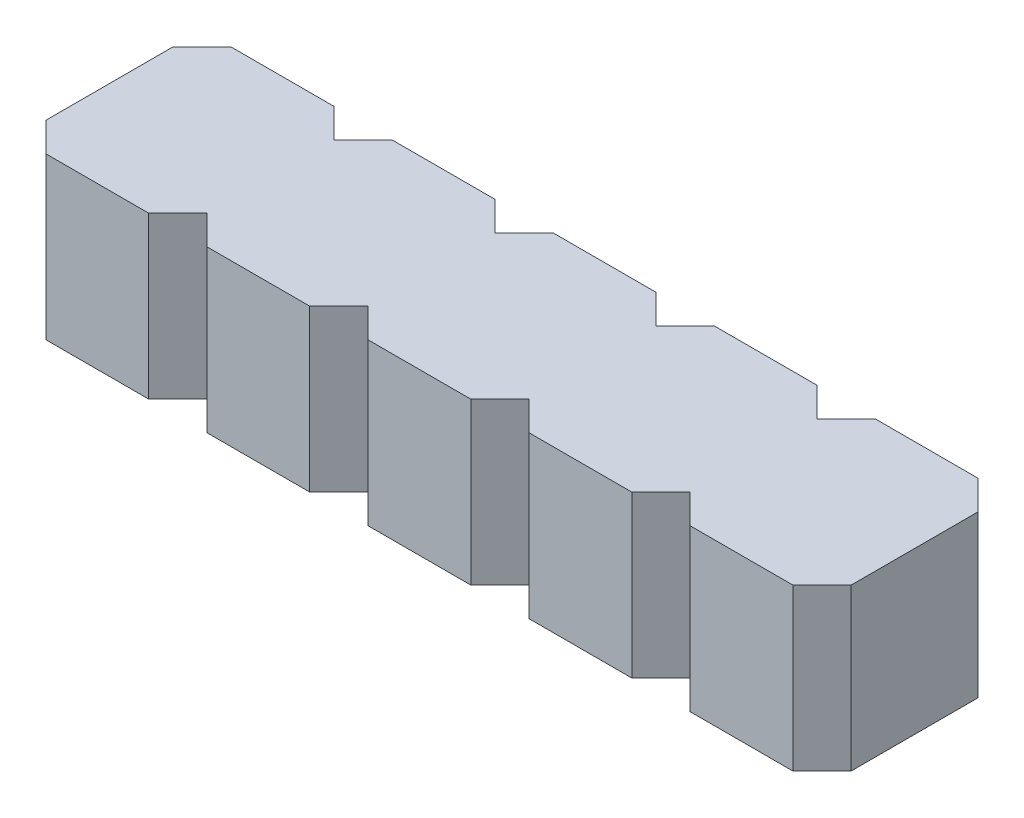
ISO-10303-21;
HEADER;
FILE_DESCRIPTION(('STEP AP214'),'2;1');
FILE_NAME('part.step','',(''),(''),'','','');
FILE_SCHEMA(('AUTOMOTIVE_DESIGN { 1 0 10303 214 1 1 1 1 }'));
ENDSEC;
DATA;
#1=APPLICATION_CONTEXT('core data for automotive mechanical design processes');
#2=APPLICATION_PROTOCOL_DEFINITION('international standard','automotive_design',2000,#1);
#3=PRODUCT_CONTEXT('',#1,'mechanical');
#4=PRODUCT('Part','Part','',(#3));
#5=PRODUCT_RELATED_PRODUCT_CATEGORY('part','',(#4));
#6=PRODUCT_DEFINITION_FORMATION('','',#4);
#7=PRODUCT_DEFINITION_CONTEXT('part definition',#1,'design');
#8=PRODUCT_DEFINITION('design','',#6,#7);
#9=PRODUCT_DEFINITION_SHAPE('','',#8);
#10=(LENGTH_UNIT() NAMED_UNIT(*) SI_UNIT(.MILLI.,.METRE.));
#11=(NAMED_UNIT(*) PLANE_ANGLE_UNIT() SI_UNIT($,.RADIAN.));
#12=(NAMED_UNIT(*) SI_UNIT($,.STERADIAN.) SOLID_ANGLE_UNIT());
#13=UNCERTAINTY_MEASURE_WITH_UNIT(LENGTH_MEASURE(1.E-05),#10,'distance_accuracy_value','');
#14=(GEOMETRIC_REPRESENTATION_CONTEXT(3) GLOBAL_UNCERTAINTY_ASSIGNED_CONTEXT((#13)) GLOBAL_UNIT_ASSIGNED_CONTEXT((#10,
#11,#12)) REPRESENTATION_CONTEXT('',''));
#15=CARTESIAN_POINT('',(0.,0.,0.));
#16=DIRECTION('',(0.,0.,1.));
#17=DIRECTION('',(1.,0.,0.));
#18=AXIS2_PLACEMENT_3D('',#15,#16,#17);
#19=CARTESIAN_POINT('',(5.08,0.,-1.46));
#20=DIRECTION('',(0.,0.,-1.));
#21=DIRECTION('',(-1.,0.,0.));
#22=AXIS2_PLACEMENT_3D('',#19,#20,#21);
#23=PLANE('',#22);
#24=DIRECTION('',(-1.,0.,0.));
#25=VECTOR('',#24,1.);
#26=CARTESIAN_POINT('',(5.08,2.54,-1.46));
#27=LINE('',#26,#25);
#28=CARTESIAN_POINT('',(4.27,2.54,-1.46));
#29=VERTEX_POINT('',#28);
#30=CARTESIAN_POINT('',(5.89,2.54,-1.46));
#31=VERTEX_POINT('',#30);
#32=EDGE_CURVE('E246',#29,#31,#27,.F.);
#33=ORIENTED_EDGE('',*,*,#32,.T.);
#34=DIRECTION('',(0.,1.,0.));
#35=VECTOR('',#34,1.);
#36=CARTESIAN_POINT('',(5.89,0.,-1.46));
#37=LINE('',#36,#35);
#38=CARTESIAN_POINT('',(5.89,0.,-1.46));
#39=VERTEX_POINT('',#38);
#40=EDGE_CURVE('E263',#39,#31,#37,.T.);
#41=ORIENTED_EDGE('',*,*,#40,.F.);
#42=DIRECTION('',(-1.,0.,0.));
#43=VECTOR('',#42,1.);
#44=CARTESIAN_POINT('',(5.08,0.,-1.46));
#45=LINE('',#44,#43);
#46=CARTESIAN_POINT('',(4.27,0.,-1.46));
#47=VERTEX_POINT('',#46);
#48=EDGE_CURVE('E20',#39,#47,#45,.T.);
#49=ORIENTED_EDGE('',*,*,#48,.T.);
#50=DIRECTION('',(0.,1.,0.));
#51=VECTOR('',#50,1.);
#52=CARTESIAN_POINT('',(4.27,0.,-1.46));
#53=LINE('',#52,#51);
#54=EDGE_CURVE('E262',#29,#47,#53,.F.);
#55=ORIENTED_EDGE('',*,*,#54,.F.);
#56=EDGE_LOOP('',(#33,#41,#49,#55));
#57=FACE_BOUND('',#56,.T.);
#58=ADVANCED_FACE('F17',(#57),#23,.T.);
#59=CARTESIAN_POINT('',(5.08,0.,1.46));
#60=DIRECTION('',(0.,0.,1.));
#61=DIRECTION('',(1.,0.,0.));
#62=AXIS2_PLACEMENT_3D('',#59,#60,#61);
#63=PLANE('',#62);
#64=DIRECTION('',(1.,0.,0.));
#65=VECTOR('',#64,1.);
#66=CARTESIAN_POINT('',(5.08,2.54,1.46));
#67=LINE('',#66,#65);
#68=CARTESIAN_POINT('',(5.89,2.54,1.46));
#69=VERTEX_POINT('',#68);
#70=CARTESIAN_POINT('',(4.27,2.54,1.46));
#71=VERTEX_POINT('',#70);
#72=EDGE_CURVE('E224',#69,#71,#67,.F.);
#73=ORIENTED_EDGE('',*,*,#72,.T.);
#74=DIRECTION('',(0.,1.,0.));
#75=VECTOR('',#74,1.);
#76=CARTESIAN_POINT('',(4.27,0.,1.46));
#77=LINE('',#76,#75);
#78=CARTESIAN_POINT('',(4.27,0.,1.46));
#79=VERTEX_POINT('',#78);
#80=EDGE_CURVE('E233',#79,#71,#77,.T.);
#81=ORIENTED_EDGE('',*,*,#80,.F.);
#82=DIRECTION('',(1.,0.,0.));
#83=VECTOR('',#82,1.);
#84=CARTESIAN_POINT('',(5.08,0.,1.46));
#85=LINE('',#84,#83);
#86=CARTESIAN_POINT('',(5.89,0.,1.46));
#87=VERTEX_POINT('',#86);
#88=EDGE_CURVE('E240',#79,#87,#85,.T.);
#89=ORIENTED_EDGE('',*,*,#88,.T.);
#90=DIRECTION('',(0.,1.,0.));
#91=VECTOR('',#90,1.);
#92=CARTESIAN_POINT('',(5.89,0.,1.46));
#93=LINE('',#92,#91);
#94=EDGE_CURVE('E285',#69,#87,#93,.F.);
#95=ORIENTED_EDGE('',*,*,#94,.F.);
#96=EDGE_LOOP('',(#73,#81,#89,#95));
#97=FACE_BOUND('',#96,.T.);
#98=ADVANCED_FACE('F248',(#97),#63,.T.);
#99=CARTESIAN_POINT('',(4.04,0.,1.23));
#100=DIRECTION('',(-0.707106781186548,0.,0.707106781186548));
#101=DIRECTION('',(0.707106781186548,0.,0.707106781186548));
#102=AXIS2_PLACEMENT_3D('',#99,#100,#101);
#103=PLANE('',#102);
#104=DIRECTION('',(0.707106781186548,0.,0.707106781186548));
#105=VECTOR('',#104,1.);
#106=CARTESIAN_POINT('',(4.04,2.54,1.23));
#107=LINE('',#106,#105);
#108=CARTESIAN_POINT('',(3.81,2.54,1.));
#109=VERTEX_POINT('',#108);
#110=EDGE_CURVE('E249',#71,#109,#107,.F.);
#111=ORIENTED_EDGE('',*,*,#110,.T.);
#112=DIRECTION('',(0.,1.,0.));
#113=VECTOR('',#112,1.);
#114=CARTESIAN_POINT('',(3.81,0.,1.));
#115=LINE('',#114,#113);
#116=CARTESIAN_POINT('',(3.81,0.,1.));
#117=VERTEX_POINT('',#116);
#118=EDGE_CURVE('E236',#117,#109,#115,.T.);
#119=ORIENTED_EDGE('',*,*,#118,.F.);
#120=DIRECTION('',(0.707106781186548,0.,0.707106781186548));
#121=VECTOR('',#120,1.);
#122=CARTESIAN_POINT('',(4.04,0.,1.23));
#123=LINE('',#122,#121);
#124=EDGE_CURVE('E230',#117,#79,#123,.T.);
#125=ORIENTED_EDGE('',*,*,#124,.T.);
#126=ORIENTED_EDGE('',*,*,#80,.T.);
#127=EDGE_LOOP('',(#111,#119,#125,#126));
#128=FACE_BOUND('',#127,.T.);
#129=ADVANCED_FACE('F232',(#128),#103,.T.);
#130=CARTESIAN_POINT('',(4.04,0.,-1.23));
#131=DIRECTION('',(-0.707106781186548,0.,-0.707106781186548));
#132=DIRECTION('',(-0.707106781186548,0.,0.707106781186548));
#133=AXIS2_PLACEMENT_3D('',#130,#131,#132);
#134=PLANE('',#133);
#135=DIRECTION('',(-0.707106781186548,0.,0.707106781186548));
#136=VECTOR('',#135,1.);
#137=CARTESIAN_POINT('',(4.04,2.54,-1.23));
#138=LINE('',#137,#136);
#139=CARTESIAN_POINT('',(3.81,2.54,-1.));
#140=VERTEX_POINT('',#139);
#141=EDGE_CURVE('E271',#140,#29,#138,.F.);
#142=ORIENTED_EDGE('',*,*,#141,.T.);
#143=ORIENTED_EDGE('',*,*,#54,.T.);
#144=DIRECTION('',(-0.707106781186548,0.,0.707106781186548));
#145=VECTOR('',#144,1.);
#146=CARTESIAN_POINT('',(4.04,0.,-1.23));
#147=LINE('',#146,#145);
#148=CARTESIAN_POINT('',(3.81,0.,-1.));
#149=VERTEX_POINT('',#148);
#150=EDGE_CURVE('E251',#47,#149,#147,.T.);
#151=ORIENTED_EDGE('',*,*,#150,.T.);
#152=DIRECTION('',(0.,1.,0.));
#153=VECTOR('',#152,1.);
#154=CARTESIAN_POINT('',(3.81,0.,-1.));
#155=LINE('',#154,#153);
#156=EDGE_CURVE('E295',#140,#149,#155,.F.);
#157=ORIENTED_EDGE('',*,*,#156,.F.);
#158=EDGE_LOOP('',(#142,#143,#151,#157));
#159=FACE_BOUND('',#158,.T.);
#160=ADVANCED_FACE('F267',(#159),#134,.T.);
#161=CARTESIAN_POINT('',(6.12,0.,-1.23));
#162=DIRECTION('',(0.707106781186548,0.,-0.707106781186548));
#163=DIRECTION('',(-0.707106781186548,0.,-0.707106781186548));
#164=AXIS2_PLACEMENT_3D('',#161,#162,#163);
#165=PLANE('',#164);
#166=DIRECTION('',(-0.707106781186548,0.,-0.707106781186548));
#167=VECTOR('',#166,1.);
#168=CARTESIAN_POINT('',(6.12,2.54,-1.23));
#169=LINE('',#168,#167);
#170=CARTESIAN_POINT('',(6.35,2.54,-1.));
#171=VERTEX_POINT('',#170);
#172=EDGE_CURVE('E280',#31,#171,#169,.F.);
#173=ORIENTED_EDGE('',*,*,#172,.T.);
#174=DIRECTION('',(0.,1.,0.));
#175=VECTOR('',#174,1.);
#176=CARTESIAN_POINT('',(6.35,0.,-1.));
#177=LINE('',#176,#175);
#178=CARTESIAN_POINT('',(6.35,0.,-1.));
#179=VERTEX_POINT('',#178);
#180=EDGE_CURVE('E299',#179,#171,#177,.T.);
#181=ORIENTED_EDGE('',*,*,#180,.F.);
#182=DIRECTION('',(-0.707106781186548,0.,-0.707106781186548));
#183=VECTOR('',#182,1.);
#184=CARTESIAN_POINT('',(6.12,0.,-1.23));
#185=LINE('',#184,#183);
#186=EDGE_CURVE('E272',#179,#39,#185,.T.);
#187=ORIENTED_EDGE('',*,*,#186,.T.);
#188=ORIENTED_EDGE('',*,*,#40,.T.);
#189=EDGE_LOOP('',(#173,#181,#187,#188));
#190=FACE_BOUND('',#189,.T.);
#191=ADVANCED_FACE('F515',(#190),#165,.T.);
#192=CARTESIAN_POINT('',(6.12,0.,1.23));
#193=DIRECTION('',(0.707106781186548,0.,0.707106781186548));
#194=DIRECTION('',(0.707106781186548,0.,-0.707106781186548));
#195=AXIS2_PLACEMENT_3D('',#192,#193,#194);
#196=PLANE('',#195);
#197=DIRECTION('',(0.707106781186548,0.,-0.707106781186548));
#198=VECTOR('',#197,1.);
#199=CARTESIAN_POINT('',(6.12,2.54,1.23));
#200=LINE('',#199,#198);
#201=CARTESIAN_POINT('',(6.35,2.54,1.));
#202=VERTEX_POINT('',#201);
#203=EDGE_CURVE('E283',#202,#69,#200,.F.);
#204=ORIENTED_EDGE('',*,*,#203,.T.);
#205=ORIENTED_EDGE('',*,*,#94,.T.);
#206=DIRECTION('',(0.707106781186548,0.,-0.707106781186548));
#207=VECTOR('',#206,1.);
#208=CARTESIAN_POINT('',(6.12,0.,1.23));
#209=LINE('',#208,#207);
#210=CARTESIAN_POINT('',(6.35,0.,1.));
#211=VERTEX_POINT('',#210);
#212=EDGE_CURVE('E244',#87,#211,#209,.T.);
#213=ORIENTED_EDGE('',*,*,#212,.T.);
#214=DIRECTION('',(0.,1.,0.));
#215=VECTOR('',#214,1.);
#216=CARTESIAN_POINT('',(6.35,0.,1.));
#217=LINE('',#216,#215);
#218=EDGE_CURVE('E308',#202,#211,#217,.F.);
#219=ORIENTED_EDGE('',*,*,#218,.F.);
#220=EDGE_LOOP('',(#204,#205,#213,#219));
#221=FACE_BOUND('',#220,.T.);
#222=ADVANCED_FACE('F575',(#221),#196,.T.);
#223=CARTESIAN_POINT('',(3.58,0.,1.23));
#224=DIRECTION('',(0.707106781186548,0.,0.707106781186548));
#225=DIRECTION('',(0.707106781186548,0.,-0.707106781186548));
#226=AXIS2_PLACEMENT_3D('',#223,#224,#225);
#227=PLANE('',#226);
#228=DIRECTION('',(0.707106781186548,0.,-0.707106781186548));
#229=VECTOR('',#228,1.);
#230=CARTESIAN_POINT('',(3.58,2.54,1.23));
#231=LINE('',#230,#229);
#232=CARTESIAN_POINT('',(3.35,2.54,1.46));
#233=VERTEX_POINT('',#232);
#234=EDGE_CURVE('E290',#109,#233,#231,.F.);
#235=ORIENTED_EDGE('',*,*,#234,.T.);
#236=DIRECTION('',(0.,1.,0.));
#237=VECTOR('',#236,1.);
#238=CARTESIAN_POINT('',(3.35,0.,1.46));
#239=LINE('',#238,#237);
#240=CARTESIAN_POINT('',(3.35,0.,1.46));
#241=VERTEX_POINT('',#240);
#242=EDGE_CURVE('E313',#241,#233,#239,.T.);
#243=ORIENTED_EDGE('',*,*,#242,.F.);
#244=DIRECTION('',(0.707106781186548,0.,-0.707106781186548));
#245=VECTOR('',#244,1.);
#246=CARTESIAN_POINT('',(3.58,0.,1.23));
#247=LINE('',#246,#245);
#248=EDGE_CURVE('E287',#241,#117,#247,.T.);
#249=ORIENTED_EDGE('',*,*,#248,.T.);
#250=ORIENTED_EDGE('',*,*,#118,.T.);
#251=EDGE_LOOP('',(#235,#243,#249,#250));
#252=FACE_BOUND('',#251,.T.);
#253=ADVANCED_FACE('F579',(#252),#227,.T.);
#254=CARTESIAN_POINT('',(3.58,0.,-1.23));
#255=DIRECTION('',(0.707106781186548,0.,-0.707106781186548));
#256=DIRECTION('',(-0.707106781186548,0.,-0.707106781186548));
#257=AXIS2_PLACEMENT_3D('',#254,#255,#256);
#258=PLANE('',#257);
#259=DIRECTION('',(-0.707106781186548,0.,-0.707106781186548));
#260=VECTOR('',#259,1.);
#261=CARTESIAN_POINT('',(3.58,2.54,-1.23));
#262=LINE('',#261,#260);
#263=CARTESIAN_POINT('',(3.35,2.54,-1.46));
#264=VERTEX_POINT('',#263);
#265=EDGE_CURVE('E293',#264,#140,#262,.F.);
#266=ORIENTED_EDGE('',*,*,#265,.T.);
#267=ORIENTED_EDGE('',*,*,#156,.T.);
#268=DIRECTION('',(-0.707106781186548,0.,-0.707106781186548));
#269=VECTOR('',#268,1.);
#270=CARTESIAN_POINT('',(3.58,0.,-1.23));
#271=LINE('',#270,#269);
#272=CARTESIAN_POINT('',(3.35,0.,-1.46));
#273=VERTEX_POINT('',#272);
#274=EDGE_CURVE('E275',#149,#273,#271,.T.);
#275=ORIENTED_EDGE('',*,*,#274,.T.);
#276=DIRECTION('',(0.,1.,0.));
#277=VECTOR('',#276,1.);
#278=CARTESIAN_POINT('',(3.35,0.,-1.46));
#279=LINE('',#278,#277);
#280=EDGE_CURVE('E322',#264,#273,#279,.F.);
#281=ORIENTED_EDGE('',*,*,#280,.F.);
#282=EDGE_LOOP('',(#266,#267,#275,#281));
#283=FACE_BOUND('',#282,.T.);
#284=ADVANCED_FACE('F509',(#283),#258,.T.);
#285=CARTESIAN_POINT('',(6.58,0.,-1.23));
#286=DIRECTION('',(-0.707106781186548,0.,-0.707106781186548));
#287=DIRECTION('',(-0.707106781186548,0.,0.707106781186548));
#288=AXIS2_PLACEMENT_3D('',#285,#286,#287);
#289=PLANE('',#288);
#290=DIRECTION('',(-0.707106781186548,0.,0.707106781186548));
#291=VECTOR('',#290,1.);
#292=CARTESIAN_POINT('',(6.58,2.54,-1.23));
#293=LINE('',#292,#291);
#294=CARTESIAN_POINT('',(6.81,2.54,-1.46));
#295=VERTEX_POINT('',#294);
#296=EDGE_CURVE('E302',#171,#295,#293,.F.);
#297=ORIENTED_EDGE('',*,*,#296,.T.);
#298=DIRECTION('',(0.,1.,0.));
#299=VECTOR('',#298,1.);
#300=CARTESIAN_POINT('',(6.81,0.,-1.46));
#301=LINE('',#300,#299);
#302=CARTESIAN_POINT('',(6.81,0.,-1.46));
#303=VERTEX_POINT('',#302);
#304=EDGE_CURVE('E327',#303,#295,#301,.T.);
#305=ORIENTED_EDGE('',*,*,#304,.F.);
#306=DIRECTION('',(-0.707106781186548,0.,0.707106781186548));
#307=VECTOR('',#306,1.);
#308=CARTESIAN_POINT('',(6.58,0.,-1.23));
#309=LINE('',#308,#307);
#310=EDGE_CURVE('E297',#303,#179,#309,.T.);
#311=ORIENTED_EDGE('',*,*,#310,.T.);
#312=ORIENTED_EDGE('',*,*,#180,.T.);
#313=EDGE_LOOP('',(#297,#305,#311,#312));
#314=FACE_BOUND('',#313,.T.);
#315=ADVANCED_FACE('F517',(#314),#289,.T.);
#316=CARTESIAN_POINT('',(6.58,0.,1.23));
#317=DIRECTION('',(-0.707106781186548,0.,0.707106781186548));
#318=DIRECTION('',(0.707106781186548,0.,0.707106781186548));
#319=AXIS2_PLACEMENT_3D('',#316,#317,#318);
#320=PLANE('',#319);
#321=DIRECTION('',(0.707106781186548,0.,0.707106781186548));
#322=VECTOR('',#321,1.);
#323=CARTESIAN_POINT('',(6.58,2.54,1.23));
#324=LINE('',#323,#322);
#325=CARTESIAN_POINT('',(6.81,2.54,1.46));
#326=VERTEX_POINT('',#325);
#327=EDGE_CURVE('E306',#326,#202,#324,.F.);
#328=ORIENTED_EDGE('',*,*,#327,.T.);
#329=ORIENTED_EDGE('',*,*,#218,.T.);
#330=DIRECTION('',(0.707106781186548,0.,0.707106781186548));
#331=VECTOR('',#330,1.);
#332=CARTESIAN_POINT('',(6.58,0.,1.23));
#333=LINE('',#332,#331);
#334=CARTESIAN_POINT('',(6.81,0.,1.46));
#335=VERTEX_POINT('',#334);
#336=EDGE_CURVE('E304',#211,#335,#333,.T.);
#337=ORIENTED_EDGE('',*,*,#336,.T.);
#338=DIRECTION('',(0.,1.,0.));
#339=VECTOR('',#338,1.);
#340=CARTESIAN_POINT('',(6.81,0.,1.46));
#341=LINE('',#340,#339);
#342=EDGE_CURVE('E336',#326,#335,#341,.F.);
#343=ORIENTED_EDGE('',*,*,#342,.F.);
#344=EDGE_LOOP('',(#328,#329,#337,#343));
#345=FACE_BOUND('',#344,.T.);
#346=ADVANCED_FACE('F571',(#345),#320,.T.);
#347=CARTESIAN_POINT('',(2.54,0.,1.46));
#348=DIRECTION('',(0.,0.,1.));
#349=DIRECTION('',(1.,0.,0.));
#350=AXIS2_PLACEMENT_3D('',#347,#348,#349);
#351=PLANE('',#350);
#352=DIRECTION('',(1.,0.,0.));
#353=VECTOR('',#352,1.);
#354=CARTESIAN_POINT('',(2.54,2.54,1.46));
#355=LINE('',#354,#353);
#356=CARTESIAN_POINT('',(1.73,2.54,1.46));
#357=VERTEX_POINT('',#356);
#358=EDGE_CURVE('E316',#233,#357,#355,.F.);
#359=ORIENTED_EDGE('',*,*,#358,.T.);
#360=DIRECTION('',(0.,1.,0.));
#361=VECTOR('',#360,1.);
#362=CARTESIAN_POINT('',(1.73,0.,1.46));
#363=LINE('',#362,#361);
#364=CARTESIAN_POINT('',(1.73,0.,1.46));
#365=VERTEX_POINT('',#364);
#366=EDGE_CURVE('E341',#365,#357,#363,.T.);
#367=ORIENTED_EDGE('',*,*,#366,.F.);
#368=DIRECTION('',(1.,0.,0.));
#369=VECTOR('',#368,1.);
#370=CARTESIAN_POINT('',(2.54,0.,1.46));
#371=LINE('',#370,#369);
#372=EDGE_CURVE('E311',#365,#241,#371,.T.);
#373=ORIENTED_EDGE('',*,*,#372,.T.);
#374=ORIENTED_EDGE('',*,*,#242,.T.);
#375=EDGE_LOOP('',(#359,#367,#373,#374));
#376=FACE_BOUND('',#375,.T.);
#377=ADVANCED_FACE('F586',(#376),#351,.T.);
#378=CARTESIAN_POINT('',(2.54,0.,-1.46));
#379=DIRECTION('',(0.,0.,-1.));
#380=DIRECTION('',(-1.,0.,0.));
#381=AXIS2_PLACEMENT_3D('',#378,#379,#380);
#382=PLANE('',#381);
#383=DIRECTION('',(-1.,0.,0.));
#384=VECTOR('',#383,1.);
#385=CARTESIAN_POINT('',(2.54,2.54,-1.46));
#386=LINE('',#385,#384);
#387=CARTESIAN_POINT('',(1.73,2.54,-1.46));
#388=VERTEX_POINT('',#387);
#389=EDGE_CURVE('E320',#388,#264,#386,.F.);
#390=ORIENTED_EDGE('',*,*,#389,.T.);
#391=ORIENTED_EDGE('',*,*,#280,.T.);
#392=DIRECTION('',(-1.,0.,0.));
#393=VECTOR('',#392,1.);
#394=CARTESIAN_POINT('',(2.54,0.,-1.46));
#395=LINE('',#394,#393);
#396=CARTESIAN_POINT('',(1.73,0.,-1.46));
#397=VERTEX_POINT('',#396);
#398=EDGE_CURVE('E318',#273,#397,#395,.T.);
#399=ORIENTED_EDGE('',*,*,#398,.T.);
#400=DIRECTION('',(0.,1.,0.));
#401=VECTOR('',#400,1.);
#402=CARTESIAN_POINT('',(1.73,0.,-1.46));
#403=LINE('',#402,#401);
#404=EDGE_CURVE('E350',#388,#397,#403,.F.);
#405=ORIENTED_EDGE('',*,*,#404,.F.);
#406=EDGE_LOOP('',(#390,#391,#399,#405));
#407=FACE_BOUND('',#406,.T.);
#408=ADVANCED_FACE('F505',(#407),#382,.T.);
#409=CARTESIAN_POINT('',(7.62,0.,-1.46));
#410=DIRECTION('',(0.,0.,-1.));
#411=DIRECTION('',(-1.,0.,0.));
#412=AXIS2_PLACEMENT_3D('',#409,#410,#411);
#413=PLANE('',#412);
#414=DIRECTION('',(-1.,0.,0.));
#415=VECTOR('',#414,1.);
#416=CARTESIAN_POINT('',(7.62,2.54,-1.46));
#417=LINE('',#416,#415);
#418=CARTESIAN_POINT('',(8.43,2.54,-1.46));
#419=VERTEX_POINT('',#418);
#420=EDGE_CURVE('E330',#295,#419,#417,.F.);
#421=ORIENTED_EDGE('',*,*,#420,.T.);
#422=DIRECTION('',(0.,1.,0.));
#423=VECTOR('',#422,1.);
#424=CARTESIAN_POINT('',(8.43,0.,-1.46));
#425=LINE('',#424,#423);
#426=CARTESIAN_POINT('',(8.43,0.,-1.46));
#427=VERTEX_POINT('',#426);
#428=EDGE_CURVE('E355',#427,#419,#425,.T.);
#429=ORIENTED_EDGE('',*,*,#428,.F.);
#430=DIRECTION('',(-1.,0.,0.));
#431=VECTOR('',#430,1.);
#432=CARTESIAN_POINT('',(7.62,0.,-1.46));
#433=LINE('',#432,#431);
#434=EDGE_CURVE('E325',#427,#303,#433,.T.);
#435=ORIENTED_EDGE('',*,*,#434,.T.);
#436=ORIENTED_EDGE('',*,*,#304,.T.);
#437=EDGE_LOOP('',(#421,#429,#435,#436));
#438=FACE_BOUND('',#437,.T.);
#439=ADVANCED_FACE('F526',(#438),#413,.T.);
#440=CARTESIAN_POINT('',(7.62,0.,1.46));
#441=DIRECTION('',(0.,0.,1.));
#442=DIRECTION('',(1.,0.,0.));
#443=AXIS2_PLACEMENT_3D('',#440,#441,#442);
#444=PLANE('',#443);
#445=DIRECTION('',(1.,0.,0.));
#446=VECTOR('',#445,1.);
#447=CARTESIAN_POINT('',(7.62,2.54,1.46));
#448=LINE('',#447,#446);
#449=CARTESIAN_POINT('',(8.43,2.54,1.46));
#450=VERTEX_POINT('',#449);
#451=EDGE_CURVE('E334',#450,#326,#448,.F.);
#452=ORIENTED_EDGE('',*,*,#451,.T.);
#453=ORIENTED_EDGE('',*,*,#342,.T.);
#454=DIRECTION('',(1.,0.,0.));
#455=VECTOR('',#454,1.);
#456=CARTESIAN_POINT('',(7.62,0.,1.46));
#457=LINE('',#456,#455);
#458=CARTESIAN_POINT('',(8.43,0.,1.46));
#459=VERTEX_POINT('',#458);
#460=EDGE_CURVE('E332',#335,#459,#457,.T.);
#461=ORIENTED_EDGE('',*,*,#460,.T.);
#462=DIRECTION('',(0.,1.,0.));
#463=VECTOR('',#462,1.);
#464=CARTESIAN_POINT('',(8.43,0.,1.46));
#465=LINE('',#464,#463);
#466=EDGE_CURVE('E364',#450,#459,#465,.F.);
#467=ORIENTED_EDGE('',*,*,#466,.F.);
#468=EDGE_LOOP('',(#452,#453,#461,#467));
#469=FACE_BOUND('',#468,.T.);
#470=ADVANCED_FACE('F567',(#469),#444,.T.);
#471=CARTESIAN_POINT('',(1.5,0.,1.23));
#472=DIRECTION('',(-0.707106781186548,0.,0.707106781186548));
#473=DIRECTION('',(0.707106781186548,0.,0.707106781186548));
#474=AXIS2_PLACEMENT_3D('',#471,#472,#473);
#475=PLANE('',#474);
#476=DIRECTION('',(0.707106781186548,0.,0.707106781186548));
#477=VECTOR('',#476,1.);
#478=CARTESIAN_POINT('',(1.5,2.54,1.23));
#479=LINE('',#478,#477);
#480=CARTESIAN_POINT('',(1.27,2.54,1.));
#481=VERTEX_POINT('',#480);
#482=EDGE_CURVE('E344',#357,#481,#479,.F.);
#483=ORIENTED_EDGE('',*,*,#482,.T.);
#484=DIRECTION('',(0.,1.,0.));
#485=VECTOR('',#484,1.);
#486=CARTESIAN_POINT('',(1.27,0.,1.));
#487=LINE('',#486,#485);
#488=CARTESIAN_POINT('',(1.27,0.,1.));
#489=VERTEX_POINT('',#488);
#490=EDGE_CURVE('E369',#489,#481,#487,.T.);
#491=ORIENTED_EDGE('',*,*,#490,.F.);
#492=DIRECTION('',(0.707106781186548,0.,0.707106781186548));
#493=VECTOR('',#492,1.);
#494=CARTESIAN_POINT('',(1.5,0.,1.23));
#495=LINE('',#494,#493);
#496=EDGE_CURVE('E339',#489,#365,#495,.T.);
#497=ORIENTED_EDGE('',*,*,#496,.T.);
#498=ORIENTED_EDGE('',*,*,#366,.T.);
#499=EDGE_LOOP('',(#483,#491,#497,#498));
#500=FACE_BOUND('',#499,.T.);
#501=ADVANCED_FACE('F589',(#500),#475,.T.);
#502=CARTESIAN_POINT('',(1.5,0.,-1.23));
#503=DIRECTION('',(-0.707106781186548,0.,-0.707106781186548));
#504=DIRECTION('',(-0.707106781186548,0.,0.707106781186548));
#505=AXIS2_PLACEMENT_3D('',#502,#503,#504);
#506=PLANE('',#505);
#507=DIRECTION('',(-0.707106781186548,0.,0.707106781186548));
#508=VECTOR('',#507,1.);
#509=CARTESIAN_POINT('',(1.5,2.54,-1.23));
#510=LINE('',#509,#508);
#511=CARTESIAN_POINT('',(1.27,2.54,-1.));
#512=VERTEX_POINT('',#511);
#513=EDGE_CURVE('E348',#512,#388,#510,.F.);
#514=ORIENTED_EDGE('',*,*,#513,.T.);
#515=ORIENTED_EDGE('',*,*,#404,.T.);
#516=DIRECTION('',(-0.707106781186548,0.,0.707106781186548));
#517=VECTOR('',#516,1.);
#518=CARTESIAN_POINT('',(1.5,0.,-1.23));
#519=LINE('',#518,#517);
#520=CARTESIAN_POINT('',(1.27,0.,-1.));
#521=VERTEX_POINT('',#520);
#522=EDGE_CURVE('E346',#397,#521,#519,.T.);
#523=ORIENTED_EDGE('',*,*,#522,.T.);
#524=DIRECTION('',(0.,1.,0.));
#525=VECTOR('',#524,1.);
#526=CARTESIAN_POINT('',(1.27,0.,-1.));
#527=LINE('',#526,#525);
#528=EDGE_CURVE('E378',#512,#521,#527,.F.);
#529=ORIENTED_EDGE('',*,*,#528,.F.);
#530=EDGE_LOOP('',(#514,#515,#523,#529));
#531=FACE_BOUND('',#530,.T.);
#532=ADVANCED_FACE('F501',(#531),#506,.T.);
#533=CARTESIAN_POINT('',(8.66,0.,-1.23));
#534=DIRECTION('',(0.707106781186548,0.,-0.707106781186548));
#535=DIRECTION('',(-0.707106781186548,0.,-0.707106781186548));
#536=AXIS2_PLACEMENT_3D('',#533,#534,#535);
#537=PLANE('',#536);
#538=DIRECTION('',(-0.707106781186548,0.,-0.707106781186548));
#539=VECTOR('',#538,1.);
#540=CARTESIAN_POINT('',(8.66,2.54,-1.23));
#541=LINE('',#540,#539);
#542=CARTESIAN_POINT('',(8.89,2.54,-1.));
#543=VERTEX_POINT('',#542);
#544=EDGE_CURVE('E358',#419,#543,#541,.F.);
#545=ORIENTED_EDGE('',*,*,#544,.T.);
#546=DIRECTION('',(0.,1.,0.));
#547=VECTOR('',#546,1.);
#548=CARTESIAN_POINT('',(8.89,0.,-1.));
#549=LINE('',#548,#547);
#550=CARTESIAN_POINT('',(8.89,0.,-1.));
#551=VERTEX_POINT('',#550);
#552=EDGE_CURVE('E383',#551,#543,#549,.T.);
#553=ORIENTED_EDGE('',*,*,#552,.F.);
#554=DIRECTION('',(-0.707106781186548,0.,-0.707106781186548));
#555=VECTOR('',#554,1.);
#556=CARTESIAN_POINT('',(8.66,0.,-1.23));
#557=LINE('',#556,#555);
#558=EDGE_CURVE('E353',#551,#427,#557,.T.);
#559=ORIENTED_EDGE('',*,*,#558,.T.);
#560=ORIENTED_EDGE('',*,*,#428,.T.);
#561=EDGE_LOOP('',(#545,#553,#559,#560));
#562=FACE_BOUND('',#561,.T.);
#563=ADVANCED_FACE('F529',(#562),#537,.T.);
#564=CARTESIAN_POINT('',(8.66,0.,1.23));
#565=DIRECTION('',(0.707106781186548,0.,0.707106781186548));
#566=DIRECTION('',(0.707106781186548,0.,-0.707106781186548));
#567=AXIS2_PLACEMENT_3D('',#564,#565,#566);
#568=PLANE('',#567);
#569=DIRECTION('',(0.707106781186548,0.,-0.707106781186548));
#570=VECTOR('',#569,1.);
#571=CARTESIAN_POINT('',(8.66,2.54,1.23));
#572=LINE('',#571,#570);
#573=CARTESIAN_POINT('',(8.89,2.54,1.));
#574=VERTEX_POINT('',#573);
#575=EDGE_CURVE('E362',#574,#450,#572,.F.);
#576=ORIENTED_EDGE('',*,*,#575,.T.);
#577=ORIENTED_EDGE('',*,*,#466,.T.);
#578=DIRECTION('',(0.707106781186548,0.,-0.707106781186548));
#579=VECTOR('',#578,1.);
#580=CARTESIAN_POINT('',(8.66,0.,1.23));
#581=LINE('',#580,#579);
#582=CARTESIAN_POINT('',(8.89,0.,1.));
#583=VERTEX_POINT('',#582);
#584=EDGE_CURVE('E360',#459,#583,#581,.T.);
#585=ORIENTED_EDGE('',*,*,#584,.T.);
#586=DIRECTION('',(0.,1.,0.));
#587=VECTOR('',#586,1.);
#588=CARTESIAN_POINT('',(8.89,0.,1.));
#589=LINE('',#588,#587);
#590=EDGE_CURVE('E392',#574,#583,#589,.F.);
#591=ORIENTED_EDGE('',*,*,#590,.F.);
#592=EDGE_LOOP('',(#576,#577,#585,#591));
#593=FACE_BOUND('',#592,.T.);
#594=ADVANCED_FACE('F563',(#593),#568,.T.);
#595=CARTESIAN_POINT('',(1.04,0.,1.23));
#596=DIRECTION('',(0.707106781186548,0.,0.707106781186548));
#597=DIRECTION('',(0.707106781186548,0.,-0.707106781186548));
#598=AXIS2_PLACEMENT_3D('',#595,#596,#597);
#599=PLANE('',#598);
#600=DIRECTION('',(0.707106781186548,0.,-0.707106781186548));
#601=VECTOR('',#600,1.);
#602=CARTESIAN_POINT('',(1.04,2.54,1.23));
#603=LINE('',#602,#601);
#604=CARTESIAN_POINT('',(0.81,2.54,1.46));
#605=VERTEX_POINT('',#604);
#606=EDGE_CURVE('E372',#481,#605,#603,.F.);
#607=ORIENTED_EDGE('',*,*,#606,.T.);
#608=DIRECTION('',(0.,1.,0.));
#609=VECTOR('',#608,1.);
#610=CARTESIAN_POINT('',(0.81,0.,1.46));
#611=LINE('',#610,#609);
#612=CARTESIAN_POINT('',(0.81,0.,1.46));
#613=VERTEX_POINT('',#612);
#614=EDGE_CURVE('E397',#613,#605,#611,.T.);
#615=ORIENTED_EDGE('',*,*,#614,.F.);
#616=DIRECTION('',(0.707106781186548,0.,-0.707106781186548));
#617=VECTOR('',#616,1.);
#618=CARTESIAN_POINT('',(1.04,0.,1.23));
#619=LINE('',#618,#617);
#620=EDGE_CURVE('E367',#613,#489,#619,.T.);
#621=ORIENTED_EDGE('',*,*,#620,.T.);
#622=ORIENTED_EDGE('',*,*,#490,.T.);
#623=EDGE_LOOP('',(#607,#615,#621,#622));
#624=FACE_BOUND('',#623,.T.);
#625=ADVANCED_FACE('F593',(#624),#599,.T.);
#626=CARTESIAN_POINT('',(1.04,0.,-1.23));
#627=DIRECTION('',(0.707106781186548,0.,-0.707106781186548));
#628=DIRECTION('',(-0.707106781186548,0.,-0.707106781186548));
#629=AXIS2_PLACEMENT_3D('',#626,#627,#628);
#630=PLANE('',#629);
#631=DIRECTION('',(-0.707106781186548,0.,-0.707106781186548));
#632=VECTOR('',#631,1.);
#633=CARTESIAN_POINT('',(1.04,2.54,-1.23));
#634=LINE('',#633,#632);
#635=CARTESIAN_POINT('',(0.81,2.54,-1.46));
#636=VERTEX_POINT('',#635);
#637=EDGE_CURVE('E376',#636,#512,#634,.F.);
#638=ORIENTED_EDGE('',*,*,#637,.T.);
#639=ORIENTED_EDGE('',*,*,#528,.T.);
#640=DIRECTION('',(-0.707106781186548,0.,-0.707106781186548));
#641=VECTOR('',#640,1.);
#642=CARTESIAN_POINT('',(1.04,0.,-1.23));
#643=LINE('',#642,#641);
#644=CARTESIAN_POINT('',(0.81,0.,-1.46));
#645=VERTEX_POINT('',#644);
#646=EDGE_CURVE('E374',#521,#645,#643,.T.);
#647=ORIENTED_EDGE('',*,*,#646,.T.);
#648=DIRECTION('',(0.,1.,0.));
#649=VECTOR('',#648,1.);
#650=CARTESIAN_POINT('',(0.81,0.,-1.46));
#651=LINE('',#650,#649);
#652=EDGE_CURVE('E406',#636,#645,#651,.F.);
#653=ORIENTED_EDGE('',*,*,#652,.F.);
#654=EDGE_LOOP('',(#638,#639,#647,#653));
#655=FACE_BOUND('',#654,.T.);
#656=ADVANCED_FACE('F497',(#655),#630,.T.);
#657=CARTESIAN_POINT('',(9.12,0.,-1.23));
#658=DIRECTION('',(-0.707106781186548,0.,-0.707106781186548));
#659=DIRECTION('',(-0.707106781186548,0.,0.707106781186548));
#660=AXIS2_PLACEMENT_3D('',#657,#658,#659);
#661=PLANE('',#660);
#662=DIRECTION('',(-0.707106781186548,0.,0.707106781186548));
#663=VECTOR('',#662,1.);
#664=CARTESIAN_POINT('',(9.12,2.54,-1.23));
#665=LINE('',#664,#663);
#666=CARTESIAN_POINT('',(9.35,2.54,-1.46));
#667=VERTEX_POINT('',#666);
#668=EDGE_CURVE('E386',#543,#667,#665,.F.);
#669=ORIENTED_EDGE('',*,*,#668,.T.);
#670=DIRECTION('',(0.,1.,0.));
#671=VECTOR('',#670,1.);
#672=CARTESIAN_POINT('',(9.35,0.,-1.46));
#673=LINE('',#672,#671);
#674=CARTESIAN_POINT('',(9.35,0.,-1.46));
#675=VERTEX_POINT('',#674);
#676=EDGE_CURVE('E411',#675,#667,#673,.T.);
#677=ORIENTED_EDGE('',*,*,#676,.F.);
#678=DIRECTION('',(-0.707106781186548,0.,0.707106781186548));
#679=VECTOR('',#678,1.);
#680=CARTESIAN_POINT('',(9.12,0.,-1.23));
#681=LINE('',#680,#679);
#682=EDGE_CURVE('E381',#675,#551,#681,.T.);
#683=ORIENTED_EDGE('',*,*,#682,.T.);
#684=ORIENTED_EDGE('',*,*,#552,.T.);
#685=EDGE_LOOP('',(#669,#677,#683,#684));
#686=FACE_BOUND('',#685,.T.);
#687=ADVANCED_FACE('F534',(#686),#661,.T.);
#688=CARTESIAN_POINT('',(9.12,0.,1.23));
#689=DIRECTION('',(-0.707106781186548,0.,0.707106781186548));
#690=DIRECTION('',(0.707106781186548,0.,0.707106781186548));
#691=AXIS2_PLACEMENT_3D('',#688,#689,#690);
#692=PLANE('',#691);
#693=DIRECTION('',(0.707106781186548,0.,0.707106781186548));
#694=VECTOR('',#693,1.);
#695=CARTESIAN_POINT('',(9.12,2.54,1.23));
#696=LINE('',#695,#694);
#697=CARTESIAN_POINT('',(9.35,2.54,1.46));
#698=VERTEX_POINT('',#697);
#699=EDGE_CURVE('E390',#698,#574,#696,.F.);
#700=ORIENTED_EDGE('',*,*,#699,.T.);
#701=ORIENTED_EDGE('',*,*,#590,.T.);
#702=DIRECTION('',(0.707106781186548,0.,0.707106781186548));
#703=VECTOR('',#702,1.);
#704=CARTESIAN_POINT('',(9.12,0.,1.23));
#705=LINE('',#704,#703);
#706=CARTESIAN_POINT('',(9.35,0.,1.46));
#707=VERTEX_POINT('',#706);
#708=EDGE_CURVE('E388',#583,#707,#705,.T.);
#709=ORIENTED_EDGE('',*,*,#708,.T.);
#710=DIRECTION('',(0.,1.,0.));
#711=VECTOR('',#710,1.);
#712=CARTESIAN_POINT('',(9.35,0.,1.46));
#713=LINE('',#712,#711);
#714=EDGE_CURVE('E418',#698,#707,#713,.F.);
#715=ORIENTED_EDGE('',*,*,#714,.F.);
#716=EDGE_LOOP('',(#700,#701,#709,#715));
#717=FACE_BOUND('',#716,.T.);
#718=ADVANCED_FACE('F557',(#717),#692,.T.);
#719=CARTESIAN_POINT('',(0.,0.,1.46));
#720=DIRECTION('',(0.,0.,1.));
#721=DIRECTION('',(1.,0.,0.));
#722=AXIS2_PLACEMENT_3D('',#719,#720,#721);
#723=PLANE('',#722);
#724=DIRECTION('',(1.,0.,0.));
#725=VECTOR('',#724,1.);
#726=CARTESIAN_POINT('',(0.,2.54,1.46));
#727=LINE('',#726,#725);
#728=CARTESIAN_POINT('',(-0.81,2.54,1.46));
#729=VERTEX_POINT('',#728);
#730=EDGE_CURVE('E400',#605,#729,#727,.F.);
#731=ORIENTED_EDGE('',*,*,#730,.T.);
#732=DIRECTION('',(0.,1.,0.));
#733=VECTOR('',#732,1.);
#734=CARTESIAN_POINT('',(-0.81,0.,1.46));
#735=LINE('',#734,#733);
#736=CARTESIAN_POINT('',(-0.81,0.,1.46));
#737=VERTEX_POINT('',#736);
#738=EDGE_CURVE('E423',#737,#729,#735,.T.);
#739=ORIENTED_EDGE('',*,*,#738,.F.);
#740=DIRECTION('',(1.,0.,0.));
#741=VECTOR('',#740,1.);
#742=CARTESIAN_POINT('',(0.,0.,1.46));
#743=LINE('',#742,#741);
#744=EDGE_CURVE('E395',#737,#613,#743,.T.);
#745=ORIENTED_EDGE('',*,*,#744,.T.);
#746=ORIENTED_EDGE('',*,*,#614,.T.);
#747=EDGE_LOOP('',(#731,#739,#745,#746));
#748=FACE_BOUND('',#747,.T.);
#749=ADVANCED_FACE('F595',(#748),#723,.T.);
#750=CARTESIAN_POINT('',(0.,0.,-1.46));
#751=DIRECTION('',(0.,0.,-1.));
#752=DIRECTION('',(-1.,0.,0.));
#753=AXIS2_PLACEMENT_3D('',#750,#751,#752);
#754=PLANE('',#753);
#755=DIRECTION('',(-1.,0.,0.));
#756=VECTOR('',#755,1.);
#757=CARTESIAN_POINT('',(0.,2.54,-1.46));
#758=LINE('',#757,#756);
#759=CARTESIAN_POINT('',(-0.81,2.54,-1.46));
#760=VERTEX_POINT('',#759);
#761=EDGE_CURVE('E404',#760,#636,#758,.F.);
#762=ORIENTED_EDGE('',*,*,#761,.T.);
#763=ORIENTED_EDGE('',*,*,#652,.T.);
#764=DIRECTION('',(-1.,0.,0.));
#765=VECTOR('',#764,1.);
#766=CARTESIAN_POINT('',(0.,0.,-1.46));
#767=LINE('',#766,#765);
#768=CARTESIAN_POINT('',(-0.81,0.,-1.46));
#769=VERTEX_POINT('',#768);
#770=EDGE_CURVE('E402',#645,#769,#767,.T.);
#771=ORIENTED_EDGE('',*,*,#770,.T.);
#772=DIRECTION('',(0.,1.,0.));
#773=VECTOR('',#772,1.);
#774=CARTESIAN_POINT('',(-0.81,0.,-1.46));
#775=LINE('',#774,#773);
#776=EDGE_CURVE('E428',#760,#769,#775,.F.);
#777=ORIENTED_EDGE('',*,*,#776,.F.);
#778=EDGE_LOOP('',(#762,#763,#771,#777));
#779=FACE_BOUND('',#778,.T.);
#780=ADVANCED_FACE('F491',(#779),#754,.T.);
#781=CARTESIAN_POINT('',(10.16,0.,-1.46));
#782=DIRECTION('',(0.,0.,-1.));
#783=DIRECTION('',(-1.,0.,0.));
#784=AXIS2_PLACEMENT_3D('',#781,#782,#783);
#785=PLANE('',#784);
#786=DIRECTION('',(-1.,0.,0.));
#787=VECTOR('',#786,1.);
#788=CARTESIAN_POINT('',(10.16,2.54,-1.46));
#789=LINE('',#788,#787);
#790=CARTESIAN_POINT('',(10.97,2.54,-1.46));
#791=VERTEX_POINT('',#790);
#792=EDGE_CURVE('E414',#667,#791,#789,.F.);
#793=ORIENTED_EDGE('',*,*,#792,.T.);
#794=DIRECTION('',(0.,1.,0.));
#795=VECTOR('',#794,1.);
#796=CARTESIAN_POINT('',(10.97,0.,-1.46));
#797=LINE('',#796,#795);
#798=CARTESIAN_POINT('',(10.97,0.,-1.46));
#799=VERTEX_POINT('',#798);
#800=EDGE_CURVE('E432',#799,#791,#797,.T.);
#801=ORIENTED_EDGE('',*,*,#800,.F.);
#802=DIRECTION('',(-1.,0.,0.));
#803=VECTOR('',#802,1.);
#804=CARTESIAN_POINT('',(10.16,0.,-1.46));
#805=LINE('',#804,#803);
#806=EDGE_CURVE('E409',#799,#675,#805,.T.);
#807=ORIENTED_EDGE('',*,*,#806,.T.);
#808=ORIENTED_EDGE('',*,*,#676,.T.);
#809=EDGE_LOOP('',(#793,#801,#807,#808));
#810=FACE_BOUND('',#809,.T.);
#811=ADVANCED_FACE('F536',(#810),#785,.T.);
#812=CARTESIAN_POINT('',(10.16,0.,1.46));
#813=DIRECTION('',(0.,0.,1.));
#814=DIRECTION('',(1.,0.,0.));
#815=AXIS2_PLACEMENT_3D('',#812,#813,#814);
#816=PLANE('',#815);
#817=DIRECTION('',(1.,0.,0.));
#818=VECTOR('',#817,1.);
#819=CARTESIAN_POINT('',(0.,2.54,1.46));
#820=LINE('',#819,#818);
#821=CARTESIAN_POINT('',(10.97,2.54,1.46));
#822=VERTEX_POINT('',#821);
#823=EDGE_CURVE('E440',#698,#822,#820,.T.);
#824=ORIENTED_EDGE('',*,*,#823,.F.);
#825=ORIENTED_EDGE('',*,*,#714,.T.);
#826=DIRECTION('',(1.,0.,0.));
#827=VECTOR('',#826,1.);
#828=CARTESIAN_POINT('',(10.16,0.,1.46));
#829=LINE('',#828,#827);
#830=CARTESIAN_POINT('',(10.97,0.,1.46));
#831=VERTEX_POINT('',#830);
#832=EDGE_CURVE('E416',#707,#831,#829,.T.);
#833=ORIENTED_EDGE('',*,*,#832,.T.);
#834=DIRECTION('',(0.,1.,0.));
#835=VECTOR('',#834,1.);
#836=CARTESIAN_POINT('',(10.97,0.,1.46));
#837=LINE('',#836,#835);
#838=EDGE_CURVE('E450',#822,#831,#837,.F.);
#839=ORIENTED_EDGE('',*,*,#838,.F.);
#840=EDGE_LOOP('',(#824,#825,#833,#839));
#841=FACE_BOUND('',#840,.T.);
#842=ADVANCED_FACE('F554',(#841),#816,.T.);
#843=CARTESIAN_POINT('',(-1.04,0.,1.23));
#844=DIRECTION('',(-0.707106781186548,0.,0.707106781186548));
#845=DIRECTION('',(0.707106781186548,0.,0.707106781186548));
#846=AXIS2_PLACEMENT_3D('',#843,#844,#845);
#847=PLANE('',#846);
#848=DIRECTION('',(0.707106781186548,0.,0.707106781186547));
#849=VECTOR('',#848,1.);
#850=CARTESIAN_POINT('',(-1.27,2.54,1.));
#851=LINE('',#850,#849);
#852=CARTESIAN_POINT('',(-1.27,2.54,1.));
#853=VERTEX_POINT('',#852);
#854=EDGE_CURVE('E437',#853,#729,#851,.T.);
#855=ORIENTED_EDGE('',*,*,#854,.F.);
#856=DIRECTION('',(0.,1.,0.));
#857=VECTOR('',#856,1.);
#858=CARTESIAN_POINT('',(-1.27,0.,1.));
#859=LINE('',#858,#857);
#860=CARTESIAN_POINT('',(-1.27,0.,1.));
#861=VERTEX_POINT('',#860);
#862=EDGE_CURVE('E453',#861,#853,#859,.T.);
#863=ORIENTED_EDGE('',*,*,#862,.F.);
#864=DIRECTION('',(0.707106781186548,0.,0.707106781186548));
#865=VECTOR('',#864,1.);
#866=CARTESIAN_POINT('',(-1.04,0.,1.23));
#867=LINE('',#866,#865);
#868=EDGE_CURVE('E421',#861,#737,#867,.T.);
#869=ORIENTED_EDGE('',*,*,#868,.T.);
#870=ORIENTED_EDGE('',*,*,#738,.T.);
#871=EDGE_LOOP('',(#855,#863,#869,#870));
#872=FACE_BOUND('',#871,.T.);
#873=ADVANCED_FACE('F481',(#872),#847,.T.);
#874=CARTESIAN_POINT('',(-1.04,0.,-1.23));
#875=DIRECTION('',(-0.707106781186548,0.,-0.707106781186548));
#876=DIRECTION('',(-0.707106781186548,0.,0.707106781186548));
#877=AXIS2_PLACEMENT_3D('',#874,#875,#876);
#878=PLANE('',#877);
#879=DIRECTION('',(-0.707106781186548,0.,0.707106781186547));
#880=VECTOR('',#879,1.);
#881=CARTESIAN_POINT('',(-0.81,2.54,-1.46));
#882=LINE('',#881,#880);
#883=CARTESIAN_POINT('',(-1.27,2.54,-1.));
#884=VERTEX_POINT('',#883);
#885=EDGE_CURVE('E435',#760,#884,#882,.T.);
#886=ORIENTED_EDGE('',*,*,#885,.F.);
#887=ORIENTED_EDGE('',*,*,#776,.T.);
#888=DIRECTION('',(-0.707106781186548,0.,0.707106781186548));
#889=VECTOR('',#888,1.);
#890=CARTESIAN_POINT('',(-1.04,0.,-1.23));
#891=LINE('',#890,#889);
#892=CARTESIAN_POINT('',(-1.27,0.,-1.));
#893=VERTEX_POINT('',#892);
#894=EDGE_CURVE('E426',#769,#893,#891,.T.);
#895=ORIENTED_EDGE('',*,*,#894,.T.);
#896=DIRECTION('',(0.,1.,0.));
#897=VECTOR('',#896,1.);
#898=CARTESIAN_POINT('',(-1.27,0.,-1.));
#899=LINE('',#898,#897);
#900=EDGE_CURVE('E458',#884,#893,#899,.F.);
#901=ORIENTED_EDGE('',*,*,#900,.F.);
#902=EDGE_LOOP('',(#886,#887,#895,#901));
#903=FACE_BOUND('',#902,.T.);
#904=ADVANCED_FACE('F488',(#903),#878,.T.);
#905=CARTESIAN_POINT('',(11.2,0.,-1.23));
#906=DIRECTION('',(0.707106781186548,0.,-0.707106781186548));
#907=DIRECTION('',(-0.707106781186548,0.,-0.707106781186548));
#908=AXIS2_PLACEMENT_3D('',#905,#906,#907);
#909=PLANE('',#908);
#910=DIRECTION('',(-0.707106781186547,0.,-0.707106781186549));
#911=VECTOR('',#910,1.);
#912=CARTESIAN_POINT('',(11.43,2.54,-1.));
#913=LINE('',#912,#911);
#914=CARTESIAN_POINT('',(11.43,2.54,-1.));
#915=VERTEX_POINT('',#914);
#916=EDGE_CURVE('E442',#915,#791,#913,.T.);
#917=ORIENTED_EDGE('',*,*,#916,.F.);
#918=DIRECTION('',(0.,1.,0.));
#919=VECTOR('',#918,1.);
#920=CARTESIAN_POINT('',(11.43,0.,-1.));
#921=LINE('',#920,#919);
#922=CARTESIAN_POINT('',(11.43,0.,-1.));
#923=VERTEX_POINT('',#922);
#924=EDGE_CURVE('E461',#923,#915,#921,.T.);
#925=ORIENTED_EDGE('',*,*,#924,.F.);
#926=DIRECTION('',(-0.707106781186548,0.,-0.707106781186548));
#927=VECTOR('',#926,1.);
#928=CARTESIAN_POINT('',(11.2,0.,-1.23));
#929=LINE('',#928,#927);
#930=EDGE_CURVE('E35',#923,#799,#929,.T.);
#931=ORIENTED_EDGE('',*,*,#930,.T.);
#932=ORIENTED_EDGE('',*,*,#800,.T.);
#933=EDGE_LOOP('',(#917,#925,#931,#932));
#934=FACE_BOUND('',#933,.T.);
#935=ADVANCED_FACE('F540',(#934),#909,.T.);
#936=CARTESIAN_POINT('',(0.,2.54,0.));
#937=DIRECTION('',(0.,1.,0.));
#938=DIRECTION('',(0.,0.,1.));
#939=AXIS2_PLACEMENT_3D('',#936,#937,#938);
#940=PLANE('',#939);
#941=ORIENTED_EDGE('',*,*,#141,.F.);
#942=ORIENTED_EDGE('',*,*,#265,.F.);
#943=ORIENTED_EDGE('',*,*,#389,.F.);
#944=ORIENTED_EDGE('',*,*,#513,.F.);
#945=ORIENTED_EDGE('',*,*,#637,.F.);
#946=ORIENTED_EDGE('',*,*,#761,.F.);
#947=ORIENTED_EDGE('',*,*,#885,.T.);
#948=DIRECTION('',(0.,0.,1.));
#949=VECTOR('',#948,1.);
#950=CARTESIAN_POINT('',(-1.27,2.54,0.));
#951=LINE('',#950,#949);
#952=EDGE_CURVE('E455',#853,#884,#951,.F.);
#953=ORIENTED_EDGE('',*,*,#952,.F.);
#954=ORIENTED_EDGE('',*,*,#854,.T.);
#955=ORIENTED_EDGE('',*,*,#730,.F.);
#956=ORIENTED_EDGE('',*,*,#606,.F.);
#957=ORIENTED_EDGE('',*,*,#482,.F.);
#958=ORIENTED_EDGE('',*,*,#358,.F.);
#959=ORIENTED_EDGE('',*,*,#234,.F.);
#960=ORIENTED_EDGE('',*,*,#110,.F.);
#961=ORIENTED_EDGE('',*,*,#72,.F.);
#962=ORIENTED_EDGE('',*,*,#203,.F.);
#963=ORIENTED_EDGE('',*,*,#327,.F.);
#964=ORIENTED_EDGE('',*,*,#451,.F.);
#965=ORIENTED_EDGE('',*,*,#575,.F.);
#966=ORIENTED_EDGE('',*,*,#699,.F.);
#967=ORIENTED_EDGE('',*,*,#823,.T.);
#968=DIRECTION('',(0.707106781186548,0.,-0.707106781186548));
#969=VECTOR('',#968,1.);
#970=CARTESIAN_POINT('',(11.2,2.54,1.23));
#971=LINE('',#970,#969);
#972=CARTESIAN_POINT('',(11.43,2.54,1.));
#973=VERTEX_POINT('',#972);
#974=EDGE_CURVE('E447',#973,#822,#971,.F.);
#975=ORIENTED_EDGE('',*,*,#974,.F.);
#976=DIRECTION('',(0.,0.,-1.));
#977=VECTOR('',#976,1.);
#978=CARTESIAN_POINT('',(11.43,2.54,0.));
#979=LINE('',#978,#977);
#980=EDGE_CURVE('E463',#915,#973,#979,.F.);
#981=ORIENTED_EDGE('',*,*,#980,.F.);
#982=ORIENTED_EDGE('',*,*,#916,.T.);
#983=ORIENTED_EDGE('',*,*,#792,.F.);
#984=ORIENTED_EDGE('',*,*,#668,.F.);
#985=ORIENTED_EDGE('',*,*,#544,.F.);
#986=ORIENTED_EDGE('',*,*,#420,.F.);
#987=ORIENTED_EDGE('',*,*,#296,.F.);
#988=ORIENTED_EDGE('',*,*,#172,.F.);
#989=ORIENTED_EDGE('',*,*,#32,.F.);
#990=EDGE_LOOP('',(#941,#942,#943,#944,#945,#946,#947,#953,#954,#955,#956,#957,#958,#959,#960,
#961,#962,#963,#964,#965,#966,#967,#975,#981,#982,#983,#984,#985,#986,#987,#988,#989));
#991=FACE_BOUND('',#990,.T.);
#992=ADVANCED_FACE('F485',(#991),#940,.T.);
#993=CARTESIAN_POINT('',(11.2,0.,1.23));
#994=DIRECTION('',(0.707106781186548,0.,0.707106781186548));
#995=DIRECTION('',(0.707106781186548,0.,-0.707106781186548));
#996=AXIS2_PLACEMENT_3D('',#993,#994,#995);
#997=PLANE('',#996);
#998=ORIENTED_EDGE('',*,*,#974,.T.);
#999=ORIENTED_EDGE('',*,*,#838,.T.);
#1000=DIRECTION('',(0.707106781186548,0.,-0.707106781186548));
#1001=VECTOR('',#1000,1.);
#1002=CARTESIAN_POINT('',(11.2,0.,1.23));
#1003=LINE('',#1002,#1001);
#1004=CARTESIAN_POINT('',(11.43,0.,1.));
#1005=VERTEX_POINT('',#1004);
#1006=EDGE_CURVE('E445',#831,#1005,#1003,.T.);
#1007=ORIENTED_EDGE('',*,*,#1006,.T.);
#1008=DIRECTION('',(0.,1.,0.));
#1009=VECTOR('',#1008,1.);
#1010=CARTESIAN_POINT('',(11.43,0.,1.));
#1011=LINE('',#1010,#1009);
#1012=EDGE_CURVE('E465',#973,#1005,#1011,.F.);
#1013=ORIENTED_EDGE('',*,*,#1012,.F.);
#1014=EDGE_LOOP('',(#998,#999,#1007,#1013));
#1015=FACE_BOUND('',#1014,.T.);
#1016=ADVANCED_FACE('F550',(#1015),#997,.T.);
#1017=CARTESIAN_POINT('',(-1.27,0.,0.));
#1018=DIRECTION('',(-1.,0.,0.));
#1019=DIRECTION('',(0.,0.,1.));
#1020=AXIS2_PLACEMENT_3D('',#1017,#1018,#1019);
#1021=PLANE('',#1020);
#1022=ORIENTED_EDGE('',*,*,#952,.T.);
#1023=ORIENTED_EDGE('',*,*,#900,.T.);
#1024=DIRECTION('',(0.,0.,1.));
#1025=VECTOR('',#1024,1.);
#1026=CARTESIAN_POINT('',(-1.27,0.,0.));
#1027=LINE('',#1026,#1025);
#1028=EDGE_CURVE('E26',#893,#861,#1027,.T.);
#1029=ORIENTED_EDGE('',*,*,#1028,.T.);
#1030=ORIENTED_EDGE('',*,*,#862,.T.);
#1031=EDGE_LOOP('',(#1022,#1023,#1029,#1030));
#1032=FACE_BOUND('',#1031,.T.);
#1033=ADVANCED_FACE('F471',(#1032),#1021,.T.);
#1034=CARTESIAN_POINT('',(11.43,0.,0.));
#1035=DIRECTION('',(1.,0.,0.));
#1036=DIRECTION('',(0.,0.,-1.));
#1037=AXIS2_PLACEMENT_3D('',#1034,#1035,#1036);
#1038=PLANE('',#1037);
#1039=ORIENTED_EDGE('',*,*,#980,.T.);
#1040=ORIENTED_EDGE('',*,*,#1012,.T.);
#1041=DIRECTION('',(0.,0.,1.));
#1042=VECTOR('',#1041,1.);
#1043=CARTESIAN_POINT('',(11.43,0.,0.));
#1044=LINE('',#1043,#1042);
#1045=EDGE_CURVE('E11',#1005,#923,#1044,.F.);
#1046=ORIENTED_EDGE('',*,*,#1045,.T.);
#1047=ORIENTED_EDGE('',*,*,#924,.T.);
#1048=EDGE_LOOP('',(#1039,#1040,#1046,#1047));
#1049=FACE_BOUND('',#1048,.T.);
#1050=ADVANCED_FACE('F545',(#1049),#1038,.T.);
#1051=CARTESIAN_POINT('',(0.,0.,0.));
#1052=DIRECTION('',(0.,1.,0.));
#1053=DIRECTION('',(0.,0.,1.));
#1054=AXIS2_PLACEMENT_3D('',#1051,#1052,#1053);
#1055=PLANE('',#1054);
#1056=ORIENTED_EDGE('',*,*,#398,.F.);
#1057=ORIENTED_EDGE('',*,*,#274,.F.);
#1058=ORIENTED_EDGE('',*,*,#150,.F.);
#1059=ORIENTED_EDGE('',*,*,#48,.F.);
#1060=ORIENTED_EDGE('',*,*,#186,.F.);
#1061=ORIENTED_EDGE('',*,*,#310,.F.);
#1062=ORIENTED_EDGE('',*,*,#434,.F.);
#1063=ORIENTED_EDGE('',*,*,#558,.F.);
#1064=ORIENTED_EDGE('',*,*,#682,.F.);
#1065=ORIENTED_EDGE('',*,*,#806,.F.);
#1066=ORIENTED_EDGE('',*,*,#930,.F.);
#1067=ORIENTED_EDGE('',*,*,#1045,.F.);
#1068=ORIENTED_EDGE('',*,*,#1006,.F.);
#1069=ORIENTED_EDGE('',*,*,#832,.F.);
#1070=ORIENTED_EDGE('',*,*,#708,.F.);
#1071=ORIENTED_EDGE('',*,*,#584,.F.);
#1072=ORIENTED_EDGE('',*,*,#460,.F.);
#1073=ORIENTED_EDGE('',*,*,#336,.F.);
#1074=ORIENTED_EDGE('',*,*,#212,.F.);
#1075=ORIENTED_EDGE('',*,*,#88,.F.);
#1076=ORIENTED_EDGE('',*,*,#124,.F.);
#1077=ORIENTED_EDGE('',*,*,#248,.F.);
#1078=ORIENTED_EDGE('',*,*,#372,.F.);
#1079=ORIENTED_EDGE('',*,*,#496,.F.);
#1080=ORIENTED_EDGE('',*,*,#620,.F.);
#1081=ORIENTED_EDGE('',*,*,#744,.F.);
#1082=ORIENTED_EDGE('',*,*,#868,.F.);
#1083=ORIENTED_EDGE('',*,*,#1028,.F.);
#1084=ORIENTED_EDGE('',*,*,#894,.F.);
#1085=ORIENTED_EDGE('',*,*,#770,.F.);
#1086=ORIENTED_EDGE('',*,*,#646,.F.);
#1087=ORIENTED_EDGE('',*,*,#522,.F.);
#1088=EDGE_LOOP('',(#1056,#1057,#1058,#1059,#1060,#1061,#1062,#1063,#1064,#1065,#1066,#1067,
#1068,#1069,#1070,#1071,#1072,#1073,#1074,#1075,#1076,#1077,#1078,#1079,#1080,#1081,#1082,#1083,
#1084,#1085,#1086,#1087));
#1089=FACE_BOUND('',#1088,.T.);
#1090=ADVANCED_FACE('F242',(#1089),#1055,.F.);
#1091=CLOSED_SHELL('',(#58,#98,#129,#160,#191,#222,#253,#284,#315,#346,#377,#408,#439,#470,#501,
#532,#563,#594,#625,#656,#687,#718,#749,#780,#811,#842,#873,#904,#935,#992,#1016,#1033,#1050,#1090));
#1092=MANIFOLD_SOLID_BREP('B1',#1091);
#1093=ADVANCED_BREP_SHAPE_REPRESENTATION('',(#18,#1092),#14);
#1094=SHAPE_DEFINITION_REPRESENTATION(#9,#1093);
ENDSEC;
END-ISO-10303-21;
